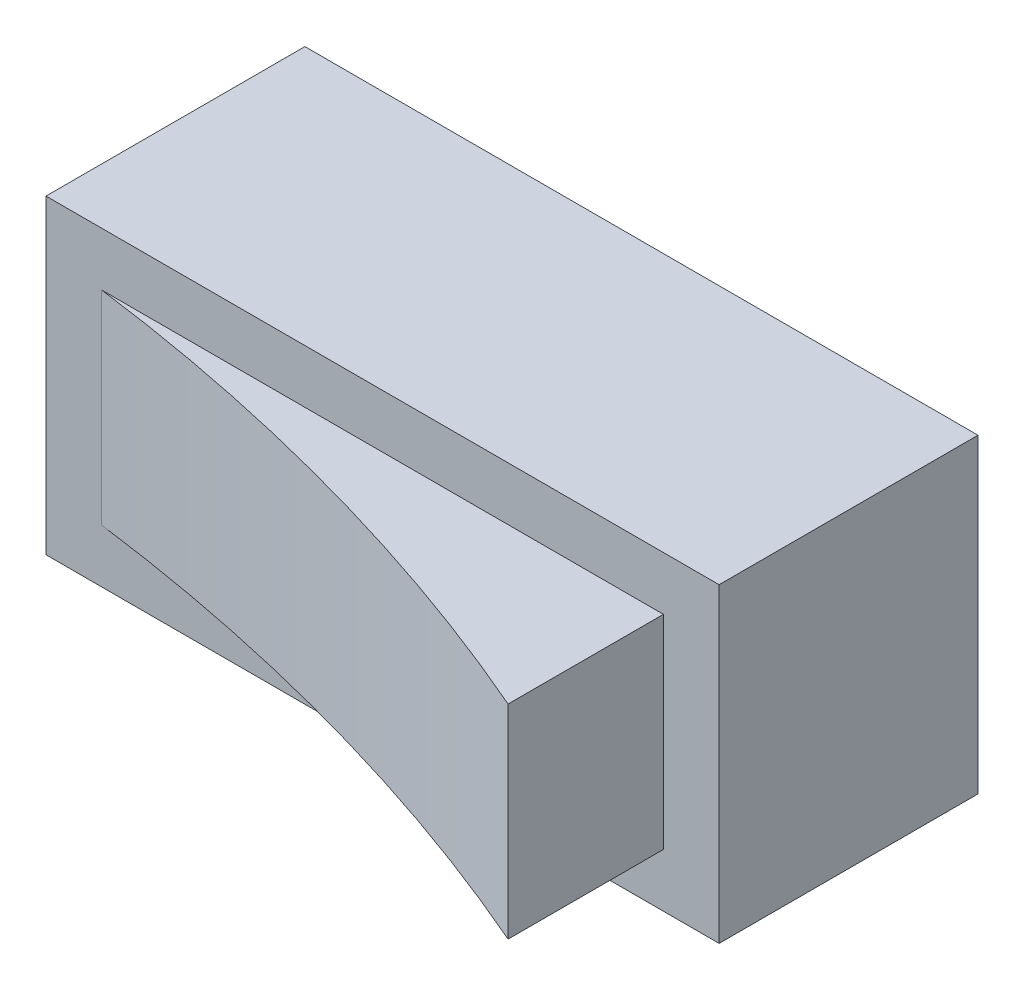
ISO-10303-21;
HEADER;
FILE_DESCRIPTION(('STEP AP214'),'2;1');
FILE_NAME('part.step','',(''),(''),'','','');
FILE_SCHEMA(('AUTOMOTIVE_DESIGN { 1 0 10303 214 1 1 1 1 }'));
ENDSEC;
DATA;
#1=APPLICATION_CONTEXT('core data for automotive mechanical design processes');
#2=APPLICATION_PROTOCOL_DEFINITION('international standard','automotive_design',2000,#1);
#3=PRODUCT_CONTEXT('',#1,'mechanical');
#4=PRODUCT('Part','Part','',(#3));
#5=PRODUCT_RELATED_PRODUCT_CATEGORY('part','',(#4));
#6=PRODUCT_DEFINITION_FORMATION('','',#4);
#7=PRODUCT_DEFINITION_CONTEXT('part definition',#1,'design');
#8=PRODUCT_DEFINITION('design','',#6,#7);
#9=PRODUCT_DEFINITION_SHAPE('','',#8);
#10=(LENGTH_UNIT() NAMED_UNIT(*) SI_UNIT(.MILLI.,.METRE.));
#11=(NAMED_UNIT(*) PLANE_ANGLE_UNIT() SI_UNIT($,.RADIAN.));
#12=(NAMED_UNIT(*) SI_UNIT($,.STERADIAN.) SOLID_ANGLE_UNIT());
#13=UNCERTAINTY_MEASURE_WITH_UNIT(LENGTH_MEASURE(1.E-05),#10,'distance_accuracy_value','');
#14=(GEOMETRIC_REPRESENTATION_CONTEXT(3) GLOBAL_UNCERTAINTY_ASSIGNED_CONTEXT((#13)) GLOBAL_UNIT_ASSIGNED_CONTEXT((#10,
#11,#12)) REPRESENTATION_CONTEXT('',''));
#15=CARTESIAN_POINT('',(0.,0.,0.));
#16=DIRECTION('',(0.,0.,1.));
#17=DIRECTION('',(1.,0.,0.));
#18=AXIS2_PLACEMENT_3D('',#15,#16,#17);
#19=CARTESIAN_POINT('',(-3.25,3.,1.25));
#20=DIRECTION('',(0.,0.,-1.));
#21=DIRECTION('',(-1.,0.,0.));
#22=AXIS2_PLACEMENT_3D('',#19,#20,#21);
#23=PLANE('',#22);
#24=DIRECTION('',(0.,-1.,0.));
#25=VECTOR('',#24,1.);
#26=CARTESIAN_POINT('',(3.25,3.,1.25));
#27=LINE('',#26,#25);
#28=CARTESIAN_POINT('',(3.25,3.,1.25));
#29=VERTEX_POINT('',#28);
#30=CARTESIAN_POINT('',(3.25,0.,1.25));
#31=VERTEX_POINT('',#30);
#32=EDGE_CURVE('E125',#29,#31,#27,.T.);
#33=ORIENTED_EDGE('',*,*,#32,.F.);
#34=DIRECTION('',(1.,0.,0.));
#35=VECTOR('',#34,1.);
#36=CARTESIAN_POINT('',(-3.25,3.,1.25));
#37=LINE('',#36,#35);
#38=CARTESIAN_POINT('',(-3.25,3.,1.25));
#39=VERTEX_POINT('',#38);
#40=EDGE_CURVE('E123',#39,#29,#37,.T.);
#41=ORIENTED_EDGE('',*,*,#40,.F.);
#42=DIRECTION('',(0.,-1.,0.));
#43=VECTOR('',#42,1.);
#44=CARTESIAN_POINT('',(-3.25,3.,1.25));
#45=LINE('',#44,#43);
#46=CARTESIAN_POINT('',(-3.25,0.,1.25));
#47=VERTEX_POINT('',#46);
#48=EDGE_CURVE('E135',#39,#47,#45,.T.);
#49=ORIENTED_EDGE('',*,*,#48,.T.);
#50=DIRECTION('',(1.,0.,0.));
#51=VECTOR('',#50,1.);
#52=CARTESIAN_POINT('',(-3.25,0.,1.25));
#53=LINE('',#52,#51);
#54=EDGE_CURVE('E119',#47,#31,#53,.T.);
#55=ORIENTED_EDGE('',*,*,#54,.T.);
#56=EDGE_LOOP('',(#33,#41,#49,#55));
#57=FACE_BOUND('',#56,.T.);
#58=DIRECTION('',(0.,1.,0.));
#59=VECTOR('',#58,1.);
#60=CARTESIAN_POINT('',(2.71216589277401,2.48317271258702,1.25));
#61=LINE('',#60,#59);
#62=CARTESIAN_POINT('',(2.71216589277401,0.51682728741298,1.25));
#63=VERTEX_POINT('',#62);
#64=CARTESIAN_POINT('',(2.71216589277401,2.48317271258702,1.25));
#65=VERTEX_POINT('',#64);
#66=EDGE_CURVE('E48',#63,#65,#61,.T.);
#67=ORIENTED_EDGE('',*,*,#66,.F.);
#68=DIRECTION('',(1.,0.,0.));
#69=VECTOR('',#68,1.);
#70=CARTESIAN_POINT('',(-2.71216589277401,0.51682728741298,1.25));
#71=LINE('',#70,#69);
#72=CARTESIAN_POINT('',(-2.71216589277401,0.51682728741298,1.25));
#73=VERTEX_POINT('',#72);
#74=EDGE_CURVE('E98',#73,#63,#71,.T.);
#75=ORIENTED_EDGE('',*,*,#74,.F.);
#76=DIRECTION('',(0.,-1.,0.));
#77=VECTOR('',#76,1.);
#78=CARTESIAN_POINT('',(-2.71216589277401,2.48317271258702,1.25));
#79=LINE('',#78,#77);
#80=CARTESIAN_POINT('',(-2.71216589277401,2.48317271258702,1.25));
#81=VERTEX_POINT('',#80);
#82=EDGE_CURVE('E91',#81,#73,#79,.T.);
#83=ORIENTED_EDGE('',*,*,#82,.F.);
#84=DIRECTION('',(-1.,0.,0.));
#85=VECTOR('',#84,1.);
#86=CARTESIAN_POINT('',(-2.71216589277401,2.48317271258702,1.25));
#87=LINE('',#86,#85);
#88=EDGE_CURVE('E53',#65,#81,#87,.T.);
#89=ORIENTED_EDGE('',*,*,#88,.F.);
#90=EDGE_LOOP('',(#67,#75,#83,#89));
#91=FACE_BOUND('',#90,.T.);
#92=ADVANCED_FACE('F33',(#57,#91),#23,.F.);
#93=CARTESIAN_POINT('',(3.25,3.,-1.25));
#94=DIRECTION('',(-1.,0.,0.));
#95=DIRECTION('',(0.,0.,1.));
#96=AXIS2_PLACEMENT_3D('',#93,#94,#95);
#97=PLANE('',#96);
#98=DIRECTION('',(0.,0.,-1.));
#99=VECTOR('',#98,1.);
#100=CARTESIAN_POINT('',(3.25,0.,-1.25));
#101=LINE('',#100,#99);
#102=CARTESIAN_POINT('',(3.25,0.,-1.25));
#103=VERTEX_POINT('',#102);
#104=EDGE_CURVE('E114',#31,#103,#101,.T.);
#105=ORIENTED_EDGE('',*,*,#104,.T.);
#106=DIRECTION('',(0.,-1.,0.));
#107=VECTOR('',#106,1.);
#108=CARTESIAN_POINT('',(3.25,3.,-1.25));
#109=LINE('',#108,#107);
#110=CARTESIAN_POINT('',(3.25,3.,-1.25));
#111=VERTEX_POINT('',#110);
#112=EDGE_CURVE('E11',#111,#103,#109,.T.);
#113=ORIENTED_EDGE('',*,*,#112,.F.);
#114=DIRECTION('',(0.,0.,-1.));
#115=VECTOR('',#114,1.);
#116=CARTESIAN_POINT('',(3.25,3.,-1.25));
#117=LINE('',#116,#115);
#118=EDGE_CURVE('E115',#29,#111,#117,.T.);
#119=ORIENTED_EDGE('',*,*,#118,.F.);
#120=ORIENTED_EDGE('',*,*,#32,.T.);
#121=EDGE_LOOP('',(#105,#113,#119,#120));
#122=FACE_BOUND('',#121,.T.);
#123=ADVANCED_FACE('F35',(#122),#97,.F.);
#124=CARTESIAN_POINT('',(-3.25,3.,-1.25));
#125=DIRECTION('',(0.,0.,1.));
#126=DIRECTION('',(1.,0.,0.));
#127=AXIS2_PLACEMENT_3D('',#124,#125,#126);
#128=PLANE('',#127);
#129=DIRECTION('',(-1.,0.,0.));
#130=VECTOR('',#129,1.);
#131=CARTESIAN_POINT('',(-3.25,0.,-1.25));
#132=LINE('',#131,#130);
#133=CARTESIAN_POINT('',(-3.25,0.,-1.25));
#134=VERTEX_POINT('',#133);
#135=EDGE_CURVE('E128',#103,#134,#132,.T.);
#136=ORIENTED_EDGE('',*,*,#135,.T.);
#137=DIRECTION('',(0.,-1.,0.));
#138=VECTOR('',#137,1.);
#139=CARTESIAN_POINT('',(-3.25,3.,-1.25));
#140=LINE('',#139,#138);
#141=CARTESIAN_POINT('',(-3.25,3.,-1.25));
#142=VERTEX_POINT('',#141);
#143=EDGE_CURVE('E41',#142,#134,#140,.T.);
#144=ORIENTED_EDGE('',*,*,#143,.F.);
#145=DIRECTION('',(-1.,0.,0.));
#146=VECTOR('',#145,1.);
#147=CARTESIAN_POINT('',(-3.25,3.,-1.25));
#148=LINE('',#147,#146);
#149=EDGE_CURVE('E118',#111,#142,#148,.T.);
#150=ORIENTED_EDGE('',*,*,#149,.F.);
#151=ORIENTED_EDGE('',*,*,#112,.T.);
#152=EDGE_LOOP('',(#136,#144,#150,#151));
#153=FACE_BOUND('',#152,.T.);
#154=ADVANCED_FACE('F157',(#153),#128,.F.);
#155=CARTESIAN_POINT('',(-3.25,3.,-1.25));
#156=DIRECTION('',(1.,0.,0.));
#157=DIRECTION('',(0.,0.,-1.));
#158=AXIS2_PLACEMENT_3D('',#155,#156,#157);
#159=PLANE('',#158);
#160=DIRECTION('',(0.,0.,1.));
#161=VECTOR('',#160,1.);
#162=CARTESIAN_POINT('',(-3.25,0.,-1.25));
#163=LINE('',#162,#161);
#164=EDGE_CURVE('E130',#134,#47,#163,.T.);
#165=ORIENTED_EDGE('',*,*,#164,.T.);
#166=ORIENTED_EDGE('',*,*,#48,.F.);
#167=DIRECTION('',(0.,0.,1.));
#168=VECTOR('',#167,1.);
#169=CARTESIAN_POINT('',(-3.25,3.,-1.25));
#170=LINE('',#169,#168);
#171=EDGE_CURVE('E121',#142,#39,#170,.T.);
#172=ORIENTED_EDGE('',*,*,#171,.F.);
#173=ORIENTED_EDGE('',*,*,#143,.T.);
#174=EDGE_LOOP('',(#165,#166,#172,#173));
#175=FACE_BOUND('',#174,.T.);
#176=ADVANCED_FACE('F142',(#175),#159,.F.);
#177=CARTESIAN_POINT('',(0.,3.,0.));
#178=DIRECTION('',(0.,1.,0.));
#179=DIRECTION('',(0.,0.,1.));
#180=AXIS2_PLACEMENT_3D('',#177,#178,#179);
#181=PLANE('',#180);
#182=ORIENTED_EDGE('',*,*,#118,.T.);
#183=ORIENTED_EDGE('',*,*,#149,.T.);
#184=ORIENTED_EDGE('',*,*,#171,.T.);
#185=ORIENTED_EDGE('',*,*,#40,.T.);
#186=EDGE_LOOP('',(#182,#183,#184,#185));
#187=FACE_BOUND('',#186,.T.);
#188=ADVANCED_FACE('F156',(#187),#181,.T.);
#189=CARTESIAN_POINT('',(0.,0.,0.));
#190=DIRECTION('',(0.,1.,0.));
#191=DIRECTION('',(0.,0.,1.));
#192=AXIS2_PLACEMENT_3D('',#189,#190,#191);
#193=PLANE('',#192);
#194=ORIENTED_EDGE('',*,*,#104,.F.);
#195=ORIENTED_EDGE('',*,*,#54,.F.);
#196=ORIENTED_EDGE('',*,*,#164,.F.);
#197=ORIENTED_EDGE('',*,*,#135,.F.);
#198=EDGE_LOOP('',(#194,#195,#196,#197));
#199=FACE_BOUND('',#198,.T.);
#200=ADVANCED_FACE('F148',(#199),#193,.F.);
#201=CARTESIAN_POINT('',(2.71216589277401,2.48317271258702,2.75));
#202=DIRECTION('',(-1.,0.,0.));
#203=DIRECTION('',(0.,0.,1.));
#204=AXIS2_PLACEMENT_3D('',#201,#202,#203);
#205=PLANE('',#204);
#206=ORIENTED_EDGE('',*,*,#66,.T.);
#207=DIRECTION('',(0.,0.,-1.));
#208=VECTOR('',#207,1.);
#209=CARTESIAN_POINT('',(2.71216589277401,2.48317271258702,2.75));
#210=LINE('',#209,#208);
#211=CARTESIAN_POINT('',(2.71216589277401,2.48317271258702,2.75));
#212=VERTEX_POINT('',#211);
#213=EDGE_CURVE('E112',#212,#65,#210,.T.);
#214=ORIENTED_EDGE('',*,*,#213,.F.);
#215=DIRECTION('',(0.,1.,0.));
#216=VECTOR('',#215,1.);
#217=CARTESIAN_POINT('',(2.71216589277401,2.48317271258702,2.75));
#218=LINE('',#217,#216);
#219=CARTESIAN_POINT('',(2.71216589277401,0.51682728741298,2.75));
#220=VERTEX_POINT('',#219);
#221=EDGE_CURVE('E106',#220,#212,#218,.T.);
#222=ORIENTED_EDGE('',*,*,#221,.F.);
#223=DIRECTION('',(0.,0.,-1.));
#224=VECTOR('',#223,1.);
#225=CARTESIAN_POINT('',(2.71216589277401,0.51682728741298,2.75));
#226=LINE('',#225,#224);
#227=EDGE_CURVE('E103',#220,#63,#226,.T.);
#228=ORIENTED_EDGE('',*,*,#227,.T.);
#229=EDGE_LOOP('',(#206,#214,#222,#228));
#230=FACE_BOUND('',#229,.T.);
#231=ADVANCED_FACE('F171',(#230),#205,.F.);
#232=CARTESIAN_POINT('',(-2.71216589277401,2.48317271258702,2.75));
#233=DIRECTION('',(0.,-1.,0.));
#234=DIRECTION('',(0.,0.,-1.));
#235=AXIS2_PLACEMENT_3D('',#232,#233,#234);
#236=PLANE('',#235);
#237=ORIENTED_EDGE('',*,*,#88,.T.);
#238=CARTESIAN_POINT('',(-5.33506555064571,2.48317271258702,21.2927770962332));
#239=DIRECTION('',(0.,-1.,0.));
#240=DIRECTION('',(0.,0.,-1.));
#241=AXIS2_PLACEMENT_3D('',#238,#239,#240);
#242=CIRCLE('',#241,20.2136715206454);
#243=EDGE_CURVE('E97',#81,#212,#242,.T.);
#244=ORIENTED_EDGE('',*,*,#243,.T.);
#245=ORIENTED_EDGE('',*,*,#213,.T.);
#246=EDGE_LOOP('',(#237,#244,#245));
#247=FACE_BOUND('',#246,.T.);
#248=ADVANCED_FACE('F176',(#247),#236,.F.);
#249=CARTESIAN_POINT('',(-2.71216589277401,0.51682728741298,2.75));
#250=DIRECTION('',(0.,1.,0.));
#251=DIRECTION('',(0.,0.,1.));
#252=AXIS2_PLACEMENT_3D('',#249,#250,#251);
#253=PLANE('',#252);
#254=ORIENTED_EDGE('',*,*,#227,.F.);
#255=CARTESIAN_POINT('',(-5.33506555064571,0.51682728741298,21.2927770962332));
#256=DIRECTION('',(0.,-1.,0.));
#257=DIRECTION('',(0.,0.,1.));
#258=AXIS2_PLACEMENT_3D('',#255,#256,#257);
#259=CIRCLE('',#258,20.2136715206454);
#260=EDGE_CURVE('E94',#73,#220,#259,.T.);
#261=ORIENTED_EDGE('',*,*,#260,.F.);
#262=ORIENTED_EDGE('',*,*,#74,.T.);
#263=EDGE_LOOP('',(#254,#261,#262));
#264=FACE_BOUND('',#263,.T.);
#265=ADVANCED_FACE('F101',(#264),#253,.F.);
#266=CARTESIAN_POINT('',(-5.33506555064571,3.,21.2927770962332));
#267=DIRECTION('',(0.,-1.,0.));
#268=DIRECTION('',(0.,0.,-1.));
#269=AXIS2_PLACEMENT_3D('',#266,#267,#268);
#270=CYLINDRICAL_SURFACE('',#269,20.2136715206454);
#271=ORIENTED_EDGE('',*,*,#82,.T.);
#272=ORIENTED_EDGE('',*,*,#260,.T.);
#273=ORIENTED_EDGE('',*,*,#221,.T.);
#274=ORIENTED_EDGE('',*,*,#243,.F.);
#275=EDGE_LOOP('',(#271,#272,#273,#274));
#276=FACE_BOUND('',#275,.T.);
#277=ADVANCED_FACE('F93',(#276),#270,.F.);
#278=CLOSED_SHELL('',(#92,#123,#154,#176,#188,#200,#231,#248,#265,#277));
#279=MANIFOLD_SOLID_BREP('B2',#278);
#280=ADVANCED_BREP_SHAPE_REPRESENTATION('',(#18,#279),#14);
#281=SHAPE_DEFINITION_REPRESENTATION(#9,#280);
ENDSEC;
END-ISO-10303-21;
